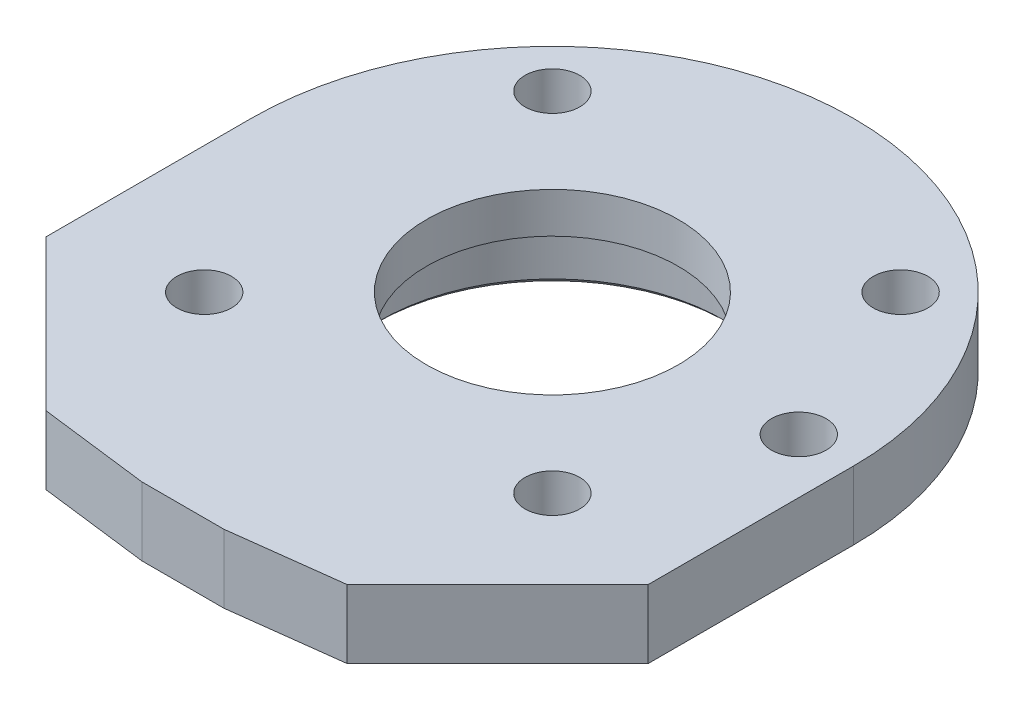
ISO-10303-21;
HEADER;
FILE_DESCRIPTION(('STEP AP214'),'2;1');
FILE_NAME('part.step','',(''),(''),'','','');
FILE_SCHEMA(('AUTOMOTIVE_DESIGN { 1 0 10303 214 1 1 1 1 }'));
ENDSEC;
DATA;
#1=APPLICATION_CONTEXT('core data for automotive mechanical design processes');
#2=APPLICATION_PROTOCOL_DEFINITION('international standard','automotive_design',2000,#1);
#3=PRODUCT_CONTEXT('',#1,'mechanical');
#4=PRODUCT('Part','Part','',(#3));
#5=PRODUCT_RELATED_PRODUCT_CATEGORY('part','',(#4));
#6=PRODUCT_DEFINITION_FORMATION('','',#4);
#7=PRODUCT_DEFINITION_CONTEXT('part definition',#1,'design');
#8=PRODUCT_DEFINITION('design','',#6,#7);
#9=PRODUCT_DEFINITION_SHAPE('','',#8);
#10=(LENGTH_UNIT() NAMED_UNIT(*) SI_UNIT(.MILLI.,.METRE.));
#11=(NAMED_UNIT(*) PLANE_ANGLE_UNIT() SI_UNIT($,.RADIAN.));
#12=(NAMED_UNIT(*) SI_UNIT($,.STERADIAN.) SOLID_ANGLE_UNIT());
#13=UNCERTAINTY_MEASURE_WITH_UNIT(LENGTH_MEASURE(1.E-05),#10,'distance_accuracy_value','');
#14=(GEOMETRIC_REPRESENTATION_CONTEXT(3) GLOBAL_UNCERTAINTY_ASSIGNED_CONTEXT((#13)) GLOBAL_UNIT_ASSIGNED_CONTEXT((#10,
#11,#12)) REPRESENTATION_CONTEXT('',''));
#15=CARTESIAN_POINT('',(0.,0.,0.));
#16=DIRECTION('',(0.,0.,1.));
#17=DIRECTION('',(1.,0.,0.));
#18=AXIS2_PLACEMENT_3D('',#15,#16,#17);
#19=CARTESIAN_POINT('',(0.,7.99999999999898,0.));
#20=DIRECTION('',(0.,-1.,0.));
#21=DIRECTION('',(1.,0.,0.));
#22=AXIS2_PLACEMENT_3D('',#19,#20,#21);
#23=CONICAL_SURFACE('',#22,64.499999999999,0.785398163396999);
#24=CARTESIAN_POINT('',(0.,7.99999999999898,0.));
#25=DIRECTION('',(0.,-1.,0.));
#26=DIRECTION('',(1.,0.,0.));
#27=AXIS2_PLACEMENT_3D('',#24,#25,#26);
#28=CIRCLE('',#27,64.499999999999);
#29=CARTESIAN_POINT('',(64.499999999999,7.99999999999898,0.));
#30=VERTEX_POINT('',#29);
#31=EDGE_CURVE('E20',#30,#30,#28,.T.);
#32=ORIENTED_EDGE('',*,*,#31,.T.);
#33=EDGE_LOOP('',(#32));
#34=FACE_BOUND('',#33,.T.);
#35=CARTESIAN_POINT('',(0.,10.,0.));
#36=DIRECTION('',(0.,1.,0.));
#37=DIRECTION('',(0.,0.,1.));
#38=AXIS2_PLACEMENT_3D('',#35,#36,#37);
#39=CIRCLE('',#38,62.5);
#40=CARTESIAN_POINT('',(0.,10.,62.5));
#41=VERTEX_POINT('',#40);
#42=EDGE_CURVE('E203',#41,#41,#39,.T.);
#43=ORIENTED_EDGE('',*,*,#42,.T.);
#44=EDGE_LOOP('',(#43));
#45=FACE_BOUND('',#44,.T.);
#46=ADVANCED_FACE('F17',(#34,#45),#23,.F.);
#47=CARTESIAN_POINT('',(0.,8.,0.));
#48=DIRECTION('',(0.,1.,0.));
#49=DIRECTION('',(0.,0.,1.));
#50=AXIS2_PLACEMENT_3D('',#47,#48,#49);
#51=CYLINDRICAL_SURFACE('',#50,62.5);
#52=CARTESIAN_POINT('',(0.,33.2,0.));
#53=DIRECTION('',(0.,1.,0.));
#54=DIRECTION('',(0.,0.,1.));
#55=AXIS2_PLACEMENT_3D('',#52,#53,#54);
#56=CIRCLE('',#55,62.5);
#57=CARTESIAN_POINT('',(0.,33.2,62.5));
#58=VERTEX_POINT('',#57);
#59=EDGE_CURVE('E269',#58,#58,#56,.T.);
#60=ORIENTED_EDGE('',*,*,#59,.T.);
#61=EDGE_LOOP('',(#60));
#62=FACE_BOUND('',#61,.T.);
#63=ORIENTED_EDGE('',*,*,#42,.F.);
#64=EDGE_LOOP('',(#63));
#65=FACE_BOUND('',#64,.T.);
#66=ADVANCED_FACE('F282',(#62,#65),#51,.F.);
#67=CARTESIAN_POINT('',(0.,8.,0.));
#68=DIRECTION('',(0.,1.,0.));
#69=DIRECTION('',(0.,0.,1.));
#70=AXIS2_PLACEMENT_3D('',#67,#68,#69);
#71=PLANE('',#70);
#72=ORIENTED_EDGE('',*,*,#31,.F.);
#73=EDGE_LOOP('',(#72));
#74=FACE_BOUND('',#73,.T.);
#75=CARTESIAN_POINT('',(0.,8.00000000000013,0.));
#76=DIRECTION('',(0.,1.,0.));
#77=DIRECTION('',(0.,0.,1.));
#78=AXIS2_PLACEMENT_3D('',#75,#76,#77);
#79=CIRCLE('',#78,72.9999999999999);
#80=CARTESIAN_POINT('',(0.,8.00000000000013,72.9999999999999));
#81=VERTEX_POINT('',#80);
#82=EDGE_CURVE('E267',#81,#81,#79,.T.);
#83=ORIENTED_EDGE('',*,*,#82,.F.);
#84=EDGE_LOOP('',(#83));
#85=FACE_BOUND('',#84,.T.);
#86=ADVANCED_FACE('F278',(#74,#85),#71,.F.);
#87=CARTESIAN_POINT('',(0.,33.2,0.));
#88=DIRECTION('',(0.,1.,0.));
#89=DIRECTION('',(0.,0.,1.));
#90=AXIS2_PLACEMENT_3D('',#87,#88,#89);
#91=PLANE('',#90);
#92=CARTESIAN_POINT('',(0.,33.2,0.));
#93=DIRECTION('',(0.,1.,0.));
#94=DIRECTION('',(0.,0.,1.));
#95=AXIS2_PLACEMENT_3D('',#92,#93,#94);
#96=CIRCLE('',#95,59.);
#97=CARTESIAN_POINT('',(0.,33.2,59.));
#98=VERTEX_POINT('',#97);
#99=EDGE_CURVE('E202',#98,#98,#96,.T.);
#100=ORIENTED_EDGE('',*,*,#99,.T.);
#101=EDGE_LOOP('',(#100));
#102=FACE_BOUND('',#101,.T.);
#103=ORIENTED_EDGE('',*,*,#59,.F.);
#104=EDGE_LOOP('',(#103));
#105=FACE_BOUND('',#104,.T.);
#106=ADVANCED_FACE('F281',(#102,#105),#91,.F.);
#107=CARTESIAN_POINT('',(0.,10.000000000001,0.));
#108=DIRECTION('',(0.,1.,0.));
#109=DIRECTION('',(0.,0.,1.));
#110=AXIS2_PLACEMENT_3D('',#107,#108,#109);
#111=CONICAL_SURFACE('',#110,74.999999999999,0.785398163397);
#112=ORIENTED_EDGE('',*,*,#82,.T.);
#113=EDGE_LOOP('',(#112));
#114=FACE_BOUND('',#113,.T.);
#115=CARTESIAN_POINT('',(0.,10.,0.));
#116=DIRECTION('',(0.,1.,0.));
#117=DIRECTION('',(0.,0.,1.));
#118=AXIS2_PLACEMENT_3D('',#115,#116,#117);
#119=CIRCLE('',#118,75.);
#120=CARTESIAN_POINT('',(0.,10.,75.));
#121=VERTEX_POINT('',#120);
#122=EDGE_CURVE('E198',#121,#121,#119,.T.);
#123=ORIENTED_EDGE('',*,*,#122,.F.);
#124=EDGE_LOOP('',(#123));
#125=FACE_BOUND('',#124,.T.);
#126=ADVANCED_FACE('F286',(#114,#125),#111,.T.);
#127=CARTESIAN_POINT('',(0.,33.2,0.));
#128=DIRECTION('',(0.,1.,0.));
#129=DIRECTION('',(0.,0.,1.));
#130=AXIS2_PLACEMENT_3D('',#127,#128,#129);
#131=CYLINDRICAL_SURFACE('',#130,59.);
#132=CARTESIAN_POINT('',(0.,35.2,0.));
#133=DIRECTION('',(0.,1.,0.));
#134=DIRECTION('',(0.,0.,1.));
#135=AXIS2_PLACEMENT_3D('',#132,#133,#134);
#136=CIRCLE('',#135,59.);
#137=CARTESIAN_POINT('',(0.,35.2,59.));
#138=VERTEX_POINT('',#137);
#139=EDGE_CURVE('E201',#138,#138,#136,.T.);
#140=ORIENTED_EDGE('',*,*,#139,.T.);
#141=EDGE_LOOP('',(#140));
#142=FACE_BOUND('',#141,.T.);
#143=ORIENTED_EDGE('',*,*,#99,.F.);
#144=EDGE_LOOP('',(#143));
#145=FACE_BOUND('',#144,.T.);
#146=ADVANCED_FACE('F289',(#142,#145),#131,.F.);
#147=CARTESIAN_POINT('',(0.,-497.410884005,0.));
#148=DIRECTION('',(0.,1.,0.));
#149=DIRECTION('',(0.,0.,1.));
#150=AXIS2_PLACEMENT_3D('',#147,#148,#149);
#151=CYLINDRICAL_SURFACE('',#150,75.);
#152=CARTESIAN_POINT('',(0.,25.,0.));
#153=DIRECTION('',(0.,1.,0.));
#154=DIRECTION('',(0.,0.,1.));
#155=AXIS2_PLACEMENT_3D('',#152,#153,#154);
#156=CIRCLE('',#155,75.);
#157=CARTESIAN_POINT('',(0.,25.,75.));
#158=VERTEX_POINT('',#157);
#159=EDGE_CURVE('E260',#158,#158,#156,.F.);
#160=ORIENTED_EDGE('',*,*,#159,.T.);
#161=EDGE_LOOP('',(#160));
#162=FACE_BOUND('',#161,.T.);
#163=ORIENTED_EDGE('',*,*,#122,.T.);
#164=EDGE_LOOP('',(#163));
#165=FACE_BOUND('',#164,.T.);
#166=ADVANCED_FACE('F293',(#162,#165),#151,.T.);
#167=CARTESIAN_POINT('',(63.6,25.,-63.6));
#168=DIRECTION('',(0.,1.,0.));
#169=DIRECTION('',(0.,0.,1.));
#170=AXIS2_PLACEMENT_3D('',#167,#168,#169);
#171=CYLINDRICAL_SURFACE('',#170,7.);
#172=CARTESIAN_POINT('',(63.6,25.,-63.6));
#173=DIRECTION('',(0.,1.,0.));
#174=DIRECTION('',(0.,0.,1.));
#175=AXIS2_PLACEMENT_3D('',#172,#173,#174);
#176=CIRCLE('',#175,7.);
#177=CARTESIAN_POINT('',(63.6,25.,-56.6));
#178=VERTEX_POINT('',#177);
#179=EDGE_CURVE('E257',#178,#178,#176,.F.);
#180=ORIENTED_EDGE('',*,*,#179,.T.);
#181=EDGE_LOOP('',(#180));
#182=FACE_BOUND('',#181,.T.);
#183=CARTESIAN_POINT('',(63.6,34.,-63.6));
#184=DIRECTION('',(0.,1.,0.));
#185=DIRECTION('',(0.,0.,1.));
#186=AXIS2_PLACEMENT_3D('',#183,#184,#185);
#187=CIRCLE('',#186,7.);
#188=CARTESIAN_POINT('',(63.6,34.,-56.6));
#189=VERTEX_POINT('',#188);
#190=EDGE_CURVE('E245',#189,#189,#187,.T.);
#191=ORIENTED_EDGE('',*,*,#190,.T.);
#192=EDGE_LOOP('',(#191));
#193=FACE_BOUND('',#192,.T.);
#194=ADVANCED_FACE('F295',(#182,#193),#171,.F.);
#195=CARTESIAN_POINT('',(-63.6,25.,-63.6));
#196=DIRECTION('',(0.,-1.,0.));
#197=DIRECTION('',(0.,0.,-1.));
#198=AXIS2_PLACEMENT_3D('',#195,#196,#197);
#199=CYLINDRICAL_SURFACE('',#198,7.);
#200=CARTESIAN_POINT('',(-63.6,25.,-63.6));
#201=DIRECTION('',(0.,-1.,0.));
#202=DIRECTION('',(0.,0.,-1.));
#203=AXIS2_PLACEMENT_3D('',#200,#201,#202);
#204=CIRCLE('',#203,7.);
#205=CARTESIAN_POINT('',(-63.6,25.,-70.6));
#206=VERTEX_POINT('',#205);
#207=EDGE_CURVE('E254',#206,#206,#204,.T.);
#208=ORIENTED_EDGE('',*,*,#207,.T.);
#209=EDGE_LOOP('',(#208));
#210=FACE_BOUND('',#209,.T.);
#211=CARTESIAN_POINT('',(-63.6,34.,-63.6));
#212=DIRECTION('',(0.,-1.,0.));
#213=DIRECTION('',(0.,0.,-1.));
#214=AXIS2_PLACEMENT_3D('',#211,#212,#213);
#215=CIRCLE('',#214,7.);
#216=CARTESIAN_POINT('',(-63.6,34.,-70.6));
#217=VERTEX_POINT('',#216);
#218=EDGE_CURVE('E242',#217,#217,#215,.T.);
#219=ORIENTED_EDGE('',*,*,#218,.F.);
#220=EDGE_LOOP('',(#219));
#221=FACE_BOUND('',#220,.T.);
#222=ADVANCED_FACE('F303',(#210,#221),#199,.F.);
#223=CARTESIAN_POINT('',(-63.6,25.,63.6));
#224=DIRECTION('',(0.,1.,0.));
#225=DIRECTION('',(0.,0.,1.));
#226=AXIS2_PLACEMENT_3D('',#223,#224,#225);
#227=CYLINDRICAL_SURFACE('',#226,7.);
#228=CARTESIAN_POINT('',(-63.6,25.,63.6));
#229=DIRECTION('',(0.,1.,0.));
#230=DIRECTION('',(0.,0.,1.));
#231=AXIS2_PLACEMENT_3D('',#228,#229,#230);
#232=CIRCLE('',#231,7.);
#233=CARTESIAN_POINT('',(-63.6,25.,70.6));
#234=VERTEX_POINT('',#233);
#235=EDGE_CURVE('E251',#234,#234,#232,.F.);
#236=ORIENTED_EDGE('',*,*,#235,.T.);
#237=EDGE_LOOP('',(#236));
#238=FACE_BOUND('',#237,.T.);
#239=CARTESIAN_POINT('',(-63.6,34.,63.6));
#240=DIRECTION('',(0.,1.,0.));
#241=DIRECTION('',(0.,0.,1.));
#242=AXIS2_PLACEMENT_3D('',#239,#240,#241);
#243=CIRCLE('',#242,7.);
#244=CARTESIAN_POINT('',(-63.6,34.,70.6));
#245=VERTEX_POINT('',#244);
#246=EDGE_CURVE('E239',#245,#245,#243,.T.);
#247=ORIENTED_EDGE('',*,*,#246,.T.);
#248=EDGE_LOOP('',(#247));
#249=FACE_BOUND('',#248,.T.);
#250=ADVANCED_FACE('F392',(#238,#249),#227,.F.);
#251=CARTESIAN_POINT('',(63.6,25.,63.6));
#252=DIRECTION('',(0.,-1.,0.));
#253=DIRECTION('',(0.,0.,-1.));
#254=AXIS2_PLACEMENT_3D('',#251,#252,#253);
#255=CYLINDRICAL_SURFACE('',#254,7.);
#256=CARTESIAN_POINT('',(63.6,25.,63.6));
#257=DIRECTION('',(0.,-1.,0.));
#258=DIRECTION('',(0.,0.,-1.));
#259=AXIS2_PLACEMENT_3D('',#256,#257,#258);
#260=CIRCLE('',#259,7.);
#261=CARTESIAN_POINT('',(63.6,25.,56.6));
#262=VERTEX_POINT('',#261);
#263=EDGE_CURVE('E248',#262,#262,#260,.T.);
#264=ORIENTED_EDGE('',*,*,#263,.T.);
#265=EDGE_LOOP('',(#264));
#266=FACE_BOUND('',#265,.T.);
#267=CARTESIAN_POINT('',(63.6,34.,63.6));
#268=DIRECTION('',(0.,-1.,0.));
#269=DIRECTION('',(0.,0.,-1.));
#270=AXIS2_PLACEMENT_3D('',#267,#268,#269);
#271=CIRCLE('',#270,7.);
#272=CARTESIAN_POINT('',(63.6,34.,56.6));
#273=VERTEX_POINT('',#272);
#274=EDGE_CURVE('E180',#273,#273,#271,.T.);
#275=ORIENTED_EDGE('',*,*,#274,.F.);
#276=EDGE_LOOP('',(#275));
#277=FACE_BOUND('',#276,.T.);
#278=ADVANCED_FACE('F388',(#266,#277),#255,.F.);
#279=CARTESIAN_POINT('',(0.,35.2,0.));
#280=DIRECTION('',(0.,1.,0.));
#281=DIRECTION('',(0.,0.,1.));
#282=AXIS2_PLACEMENT_3D('',#279,#280,#281);
#283=PLANE('',#282);
#284=CARTESIAN_POINT('',(0.,35.2,0.));
#285=DIRECTION('',(0.,1.,0.));
#286=DIRECTION('',(0.,0.,1.));
#287=AXIS2_PLACEMENT_3D('',#284,#285,#286);
#288=CIRCLE('',#287,46.);
#289=CARTESIAN_POINT('',(0.,35.2,46.));
#290=VERTEX_POINT('',#289);
#291=EDGE_CURVE('E232',#290,#290,#288,.T.);
#292=ORIENTED_EDGE('',*,*,#291,.T.);
#293=EDGE_LOOP('',(#292));
#294=FACE_BOUND('',#293,.T.);
#295=ORIENTED_EDGE('',*,*,#139,.F.);
#296=EDGE_LOOP('',(#295));
#297=FACE_BOUND('',#296,.T.);
#298=ADVANCED_FACE('F384',(#294,#297),#283,.F.);
#299=CARTESIAN_POINT('',(0.,25.,0.));
#300=DIRECTION('',(0.,1.,0.));
#301=DIRECTION('',(0.,0.,1.));
#302=AXIS2_PLACEMENT_3D('',#299,#300,#301);
#303=PLANE('',#302);
#304=CARTESIAN_POINT('',(90.,25.,0.));
#305=DIRECTION('',(0.,1.,0.));
#306=DIRECTION('',(0.,0.,1.));
#307=AXIS2_PLACEMENT_3D('',#304,#305,#306);
#308=CIRCLE('',#307,10.);
#309=CARTESIAN_POINT('',(90.,25.,10.));
#310=VERTEX_POINT('',#309);
#311=EDGE_CURVE('E229',#310,#310,#308,.T.);
#312=ORIENTED_EDGE('',*,*,#311,.T.);
#313=EDGE_LOOP('',(#312));
#314=FACE_BOUND('',#313,.T.);
#315=ORIENTED_EDGE('',*,*,#263,.F.);
#316=EDGE_LOOP('',(#315));
#317=FACE_BOUND('',#316,.T.);
#318=ORIENTED_EDGE('',*,*,#235,.F.);
#319=EDGE_LOOP('',(#318));
#320=FACE_BOUND('',#319,.T.);
#321=ORIENTED_EDGE('',*,*,#207,.F.);
#322=EDGE_LOOP('',(#321));
#323=FACE_BOUND('',#322,.T.);
#324=ORIENTED_EDGE('',*,*,#179,.F.);
#325=EDGE_LOOP('',(#324));
#326=FACE_BOUND('',#325,.T.);
#327=ORIENTED_EDGE('',*,*,#159,.F.);
#328=EDGE_LOOP('',(#327));
#329=FACE_BOUND('',#328,.T.);
#330=DIRECTION('',(0.707106781186548,0.,-0.707106781186548));
#331=VECTOR('',#330,1.);
#332=CARTESIAN_POINT('',(55.,25.,130.));
#333=LINE('',#332,#331);
#334=CARTESIAN_POINT('',(55.0000000000004,25.,130.000000000003));
#335=VERTEX_POINT('',#334);
#336=CARTESIAN_POINT('',(110.,25.,75.));
#337=VERTEX_POINT('',#336);
#338=EDGE_CURVE('E65',#335,#337,#333,.T.);
#339=ORIENTED_EDGE('',*,*,#338,.F.);
#340=DIRECTION('',(0.992277876713698,0.,-0.124034734588962));
#341=VECTOR('',#340,1.);
#342=CARTESIAN_POINT('',(15.,25.,135.));
#343=LINE('',#342,#341);
#344=CARTESIAN_POINT('',(15.,25.,135.));
#345=VERTEX_POINT('',#344);
#346=EDGE_CURVE('E142',#345,#335,#343,.T.);
#347=ORIENTED_EDGE('',*,*,#346,.F.);
#348=DIRECTION('',(1.,0.,0.));
#349=VECTOR('',#348,1.);
#350=CARTESIAN_POINT('',(-15.,25.,135.));
#351=LINE('',#350,#349);
#352=CARTESIAN_POINT('',(-14.9999999999996,25.,134.999999999997));
#353=VERTEX_POINT('',#352);
#354=EDGE_CURVE('E153',#353,#345,#351,.T.);
#355=ORIENTED_EDGE('',*,*,#354,.F.);
#356=DIRECTION('',(0.992277876713698,0.,0.124034734588962));
#357=VECTOR('',#356,1.);
#358=CARTESIAN_POINT('',(-55.,25.,130.));
#359=LINE('',#358,#357);
#360=CARTESIAN_POINT('',(-55.,25.,130.));
#361=VERTEX_POINT('',#360);
#362=EDGE_CURVE('E163',#361,#353,#359,.T.);
#363=ORIENTED_EDGE('',*,*,#362,.F.);
#364=DIRECTION('',(0.707106781186548,0.,0.707106781186548));
#365=VECTOR('',#364,1.);
#366=CARTESIAN_POINT('',(-110.,25.,75.));
#367=LINE('',#366,#365);
#368=CARTESIAN_POINT('',(-110.,25.,75.));
#369=VERTEX_POINT('',#368);
#370=EDGE_CURVE('E98',#369,#361,#367,.T.);
#371=ORIENTED_EDGE('',*,*,#370,.F.);
#372=DIRECTION('',(0.,0.,1.));
#373=VECTOR('',#372,1.);
#374=CARTESIAN_POINT('',(-110.,25.,0.));
#375=LINE('',#374,#373);
#376=CARTESIAN_POINT('',(-110.,25.,0.));
#377=VERTEX_POINT('',#376);
#378=EDGE_CURVE('E57',#377,#369,#375,.T.);
#379=ORIENTED_EDGE('',*,*,#378,.F.);
#380=CARTESIAN_POINT('',(0.,25.,0.));
#381=DIRECTION('',(0.,1.,0.));
#382=DIRECTION('',(0.,0.,1.));
#383=AXIS2_PLACEMENT_3D('',#380,#381,#382);
#384=CIRCLE('',#383,110.);
#385=CARTESIAN_POINT('',(110.,25.,0.));
#386=VERTEX_POINT('',#385);
#387=EDGE_CURVE('E128',#386,#377,#384,.T.);
#388=ORIENTED_EDGE('',*,*,#387,.F.);
#389=DIRECTION('',(0.,0.,-1.));
#390=VECTOR('',#389,1.);
#391=CARTESIAN_POINT('',(110.,25.,75.));
#392=LINE('',#391,#390);
#393=EDGE_CURVE('E50',#337,#386,#392,.T.);
#394=ORIENTED_EDGE('',*,*,#393,.F.);
#395=EDGE_LOOP('',(#339,#347,#355,#363,#371,#379,#388,#394));
#396=FACE_BOUND('',#395,.T.);
#397=ADVANCED_FACE('F380',(#314,#317,#320,#323,#326,#329,#396),#303,.F.);
#398=CARTESIAN_POINT('',(63.6,34.,-63.6));
#399=DIRECTION('',(0.,-1.,0.));
#400=DIRECTION('',(0.,0.,-1.));
#401=AXIS2_PLACEMENT_3D('',#398,#399,#400);
#402=PLANE('',#401);
#403=ORIENTED_EDGE('',*,*,#190,.F.);
#404=EDGE_LOOP('',(#403));
#405=FACE_BOUND('',#404,.T.);
#406=CARTESIAN_POINT('',(63.6,34.,-63.6));
#407=DIRECTION('',(0.,-1.,0.));
#408=DIRECTION('',(0.,0.,-1.));
#409=AXIS2_PLACEMENT_3D('',#406,#407,#408);
#410=CIRCLE('',#409,10.);
#411=CARTESIAN_POINT('',(63.6,34.,-73.6));
#412=VERTEX_POINT('',#411);
#413=EDGE_CURVE('E226',#412,#412,#410,.F.);
#414=ORIENTED_EDGE('',*,*,#413,.T.);
#415=EDGE_LOOP('',(#414));
#416=FACE_BOUND('',#415,.T.);
#417=ADVANCED_FACE('F376',(#405,#416),#402,.F.);
#418=CARTESIAN_POINT('',(-63.6,34.,-63.6));
#419=DIRECTION('',(0.,1.,0.));
#420=DIRECTION('',(0.,0.,1.));
#421=AXIS2_PLACEMENT_3D('',#418,#419,#420);
#422=PLANE('',#421);
#423=ORIENTED_EDGE('',*,*,#218,.T.);
#424=EDGE_LOOP('',(#423));
#425=FACE_BOUND('',#424,.T.);
#426=CARTESIAN_POINT('',(-63.6,34.,-63.6));
#427=DIRECTION('',(0.,1.,0.));
#428=DIRECTION('',(0.,0.,1.));
#429=AXIS2_PLACEMENT_3D('',#426,#427,#428);
#430=CIRCLE('',#429,10.);
#431=CARTESIAN_POINT('',(-63.6,34.,-53.6));
#432=VERTEX_POINT('',#431);
#433=EDGE_CURVE('E223',#432,#432,#430,.T.);
#434=ORIENTED_EDGE('',*,*,#433,.T.);
#435=EDGE_LOOP('',(#434));
#436=FACE_BOUND('',#435,.T.);
#437=ADVANCED_FACE('F372',(#425,#436),#422,.T.);
#438=CARTESIAN_POINT('',(-63.6,34.,63.6));
#439=DIRECTION('',(0.,-1.,0.));
#440=DIRECTION('',(0.,0.,-1.));
#441=AXIS2_PLACEMENT_3D('',#438,#439,#440);
#442=PLANE('',#441);
#443=ORIENTED_EDGE('',*,*,#246,.F.);
#444=EDGE_LOOP('',(#443));
#445=FACE_BOUND('',#444,.T.);
#446=CARTESIAN_POINT('',(-63.6,34.,63.6));
#447=DIRECTION('',(0.,-1.,0.));
#448=DIRECTION('',(0.,0.,-1.));
#449=AXIS2_PLACEMENT_3D('',#446,#447,#448);
#450=CIRCLE('',#449,10.);
#451=CARTESIAN_POINT('',(-63.6,34.,53.6));
#452=VERTEX_POINT('',#451);
#453=EDGE_CURVE('E117',#452,#452,#450,.F.);
#454=ORIENTED_EDGE('',*,*,#453,.T.);
#455=EDGE_LOOP('',(#454));
#456=FACE_BOUND('',#455,.T.);
#457=ADVANCED_FACE('F368',(#445,#456),#442,.F.);
#458=CARTESIAN_POINT('',(63.6,34.,63.6));
#459=DIRECTION('',(0.,1.,0.));
#460=DIRECTION('',(0.,0.,1.));
#461=AXIS2_PLACEMENT_3D('',#458,#459,#460);
#462=PLANE('',#461);
#463=ORIENTED_EDGE('',*,*,#274,.T.);
#464=EDGE_LOOP('',(#463));
#465=FACE_BOUND('',#464,.T.);
#466=CARTESIAN_POINT('',(63.6,34.,63.6));
#467=DIRECTION('',(0.,1.,0.));
#468=DIRECTION('',(0.,0.,1.));
#469=AXIS2_PLACEMENT_3D('',#466,#467,#468);
#470=CIRCLE('',#469,10.);
#471=CARTESIAN_POINT('',(63.6,34.,73.6));
#472=VERTEX_POINT('',#471);
#473=EDGE_CURVE('E114',#472,#472,#470,.T.);
#474=ORIENTED_EDGE('',*,*,#473,.T.);
#475=EDGE_LOOP('',(#474));
#476=FACE_BOUND('',#475,.T.);
#477=ADVANCED_FACE('F365',(#465,#476),#462,.T.);
#478=CARTESIAN_POINT('',(-110.,0.,0.));
#479=DIRECTION('',(-1.,0.,0.));
#480=DIRECTION('',(0.,0.,1.));
#481=AXIS2_PLACEMENT_3D('',#478,#479,#480);
#482=PLANE('',#481);
#483=DIRECTION('',(0.,1.,0.));
#484=VECTOR('',#483,1.);
#485=CARTESIAN_POINT('',(-110.,0.,0.));
#486=LINE('',#485,#484);
#487=CARTESIAN_POINT('',(-110.,50.,0.));
#488=VERTEX_POINT('',#487);
#489=EDGE_CURVE('E125',#377,#488,#486,.T.);
#490=ORIENTED_EDGE('',*,*,#489,.F.);
#491=ORIENTED_EDGE('',*,*,#378,.T.);
#492=DIRECTION('',(0.,1.,0.));
#493=VECTOR('',#492,1.);
#494=CARTESIAN_POINT('',(-110.,0.,75.));
#495=LINE('',#494,#493);
#496=CARTESIAN_POINT('',(-110.,50.,75.));
#497=VERTEX_POINT('',#496);
#498=EDGE_CURVE('E91',#497,#369,#495,.F.);
#499=ORIENTED_EDGE('',*,*,#498,.F.);
#500=DIRECTION('',(0.,0.,1.));
#501=VECTOR('',#500,1.);
#502=CARTESIAN_POINT('',(-110.,50.,0.));
#503=LINE('',#502,#501);
#504=EDGE_CURVE('E95',#488,#497,#503,.T.);
#505=ORIENTED_EDGE('',*,*,#504,.F.);
#506=EDGE_LOOP('',(#490,#491,#499,#505));
#507=FACE_BOUND('',#506,.T.);
#508=ADVANCED_FACE('F93',(#507),#482,.T.);
#509=CARTESIAN_POINT('',(-110.,0.,75.));
#510=DIRECTION('',(-0.707106781186548,0.,0.707106781186548));
#511=DIRECTION('',(0.707106781186548,0.,0.707106781186548));
#512=AXIS2_PLACEMENT_3D('',#509,#510,#511);
#513=PLANE('',#512);
#514=ORIENTED_EDGE('',*,*,#498,.T.);
#515=ORIENTED_EDGE('',*,*,#370,.T.);
#516=DIRECTION('',(0.,1.,0.));
#517=VECTOR('',#516,1.);
#518=CARTESIAN_POINT('',(-55.,0.,130.));
#519=LINE('',#518,#517);
#520=CARTESIAN_POINT('',(-55.,50.,130.));
#521=VERTEX_POINT('',#520);
#522=EDGE_CURVE('E104',#521,#361,#519,.F.);
#523=ORIENTED_EDGE('',*,*,#522,.F.);
#524=DIRECTION('',(0.707106781186548,0.,0.707106781186548));
#525=VECTOR('',#524,1.);
#526=CARTESIAN_POINT('',(-110.,50.,75.));
#527=LINE('',#526,#525);
#528=EDGE_CURVE('E101',#497,#521,#527,.T.);
#529=ORIENTED_EDGE('',*,*,#528,.F.);
#530=EDGE_LOOP('',(#514,#515,#523,#529));
#531=FACE_BOUND('',#530,.T.);
#532=ADVANCED_FACE('F102',(#531),#513,.T.);
#533=CARTESIAN_POINT('',(-55.,0.,130.));
#534=DIRECTION('',(-0.124034734588962,0.,0.992277876713698));
#535=DIRECTION('',(0.992277876713698,0.,0.124034734588962));
#536=AXIS2_PLACEMENT_3D('',#533,#534,#535);
#537=PLANE('',#536);
#538=ORIENTED_EDGE('',*,*,#522,.T.);
#539=ORIENTED_EDGE('',*,*,#362,.T.);
#540=DIRECTION('',(0.,1.,0.));
#541=VECTOR('',#540,1.);
#542=CARTESIAN_POINT('',(-15.,0.,135.));
#543=LINE('',#542,#541);
#544=CARTESIAN_POINT('',(-15.0000000000001,50.,135.));
#545=VERTEX_POINT('',#544);
#546=EDGE_CURVE('E160',#545,#353,#543,.F.);
#547=ORIENTED_EDGE('',*,*,#546,.F.);
#548=DIRECTION('',(0.992277876713668,0.,0.124034734589209));
#549=VECTOR('',#548,1.);
#550=CARTESIAN_POINT('',(-55.,50.,130.));
#551=LINE('',#550,#549);
#552=EDGE_CURVE('E108',#521,#545,#551,.T.);
#553=ORIENTED_EDGE('',*,*,#552,.F.);
#554=EDGE_LOOP('',(#538,#539,#547,#553));
#555=FACE_BOUND('',#554,.T.);
#556=ADVANCED_FACE('F356',(#555),#537,.T.);
#557=CARTESIAN_POINT('',(-15.,0.,135.));
#558=DIRECTION('',(0.,0.,1.));
#559=DIRECTION('',(1.,0.,0.));
#560=AXIS2_PLACEMENT_3D('',#557,#558,#559);
#561=PLANE('',#560);
#562=ORIENTED_EDGE('',*,*,#546,.T.);
#563=ORIENTED_EDGE('',*,*,#354,.T.);
#564=DIRECTION('',(0.,1.,0.));
#565=VECTOR('',#564,1.);
#566=CARTESIAN_POINT('',(15.,0.,135.));
#567=LINE('',#566,#565);
#568=CARTESIAN_POINT('',(15.,50.,135.));
#569=VERTEX_POINT('',#568);
#570=EDGE_CURVE('E150',#569,#345,#567,.F.);
#571=ORIENTED_EDGE('',*,*,#570,.F.);
#572=DIRECTION('',(1.,0.,0.));
#573=VECTOR('',#572,1.);
#574=CARTESIAN_POINT('',(0.,50.,135.));
#575=LINE('',#574,#573);
#576=EDGE_CURVE('E147',#545,#569,#575,.T.);
#577=ORIENTED_EDGE('',*,*,#576,.F.);
#578=EDGE_LOOP('',(#562,#563,#571,#577));
#579=FACE_BOUND('',#578,.T.);
#580=ADVANCED_FACE('F352',(#579),#561,.T.);
#581=CARTESIAN_POINT('',(15.,0.,135.));
#582=DIRECTION('',(0.124034734588962,0.,0.992277876713698));
#583=DIRECTION('',(0.992277876713698,0.,-0.124034734588962));
#584=AXIS2_PLACEMENT_3D('',#581,#582,#583);
#585=PLANE('',#584);
#586=ORIENTED_EDGE('',*,*,#570,.T.);
#587=ORIENTED_EDGE('',*,*,#346,.T.);
#588=DIRECTION('',(0.,1.,0.));
#589=VECTOR('',#588,1.);
#590=CARTESIAN_POINT('',(55.,0.,130.));
#591=LINE('',#590,#589);
#592=CARTESIAN_POINT('',(55.,50.,130.));
#593=VERTEX_POINT('',#592);
#594=EDGE_CURVE('E140',#593,#335,#591,.F.);
#595=ORIENTED_EDGE('',*,*,#594,.F.);
#596=DIRECTION('',(0.992277876713668,0.,-0.124034734589209));
#597=VECTOR('',#596,1.);
#598=CARTESIAN_POINT('',(15.,50.,135.));
#599=LINE('',#598,#597);
#600=EDGE_CURVE('E137',#569,#593,#599,.T.);
#601=ORIENTED_EDGE('',*,*,#600,.F.);
#602=EDGE_LOOP('',(#586,#587,#595,#601));
#603=FACE_BOUND('',#602,.T.);
#604=ADVANCED_FACE('F349',(#603),#585,.T.);
#605=CARTESIAN_POINT('',(55.,0.,130.));
#606=DIRECTION('',(0.707106781186548,0.,0.707106781186548));
#607=DIRECTION('',(0.707106781186548,0.,-0.707106781186548));
#608=AXIS2_PLACEMENT_3D('',#605,#606,#607);
#609=PLANE('',#608);
#610=ORIENTED_EDGE('',*,*,#594,.T.);
#611=ORIENTED_EDGE('',*,*,#338,.T.);
#612=DIRECTION('',(0.,1.,0.));
#613=VECTOR('',#612,1.);
#614=CARTESIAN_POINT('',(110.,0.,75.));
#615=LINE('',#614,#613);
#616=CARTESIAN_POINT('',(110.,50.,75.));
#617=VERTEX_POINT('',#616);
#618=EDGE_CURVE('E129',#617,#337,#615,.F.);
#619=ORIENTED_EDGE('',*,*,#618,.F.);
#620=DIRECTION('',(0.707106781186548,0.,-0.707106781186548));
#621=VECTOR('',#620,1.);
#622=CARTESIAN_POINT('',(55.,50.,130.));
#623=LINE('',#622,#621);
#624=EDGE_CURVE('E133',#593,#617,#623,.T.);
#625=ORIENTED_EDGE('',*,*,#624,.F.);
#626=EDGE_LOOP('',(#610,#611,#619,#625));
#627=FACE_BOUND('',#626,.T.);
#628=ADVANCED_FACE('F346',(#627),#609,.T.);
#629=CARTESIAN_POINT('',(110.,0.,75.));
#630=DIRECTION('',(1.,0.,0.));
#631=DIRECTION('',(0.,0.,-1.));
#632=AXIS2_PLACEMENT_3D('',#629,#630,#631);
#633=PLANE('',#632);
#634=ORIENTED_EDGE('',*,*,#618,.T.);
#635=ORIENTED_EDGE('',*,*,#393,.T.);
#636=DIRECTION('',(0.,1.,0.));
#637=VECTOR('',#636,1.);
#638=CARTESIAN_POINT('',(110.,0.,0.));
#639=LINE('',#638,#637);
#640=CARTESIAN_POINT('',(110.,50.,0.));
#641=VERTEX_POINT('',#640);
#642=EDGE_CURVE('E35',#641,#386,#639,.F.);
#643=ORIENTED_EDGE('',*,*,#642,.F.);
#644=DIRECTION('',(0.,0.,1.));
#645=VECTOR('',#644,1.);
#646=CARTESIAN_POINT('',(110.,50.,0.));
#647=LINE('',#646,#645);
#648=EDGE_CURVE('E136',#617,#641,#647,.F.);
#649=ORIENTED_EDGE('',*,*,#648,.F.);
#650=EDGE_LOOP('',(#634,#635,#643,#649));
#651=FACE_BOUND('',#650,.T.);
#652=ADVANCED_FACE('F342',(#651),#633,.T.);
#653=CARTESIAN_POINT('',(0.,0.,0.));
#654=DIRECTION('',(0.,1.,0.));
#655=DIRECTION('',(0.,0.,1.));
#656=AXIS2_PLACEMENT_3D('',#653,#654,#655);
#657=CYLINDRICAL_SURFACE('',#656,110.);
#658=ORIENTED_EDGE('',*,*,#642,.T.);
#659=ORIENTED_EDGE('',*,*,#387,.T.);
#660=ORIENTED_EDGE('',*,*,#489,.T.);
#661=CARTESIAN_POINT('',(0.,50.,0.));
#662=DIRECTION('',(0.,1.,0.));
#663=DIRECTION('',(0.,0.,1.));
#664=AXIS2_PLACEMENT_3D('',#661,#662,#663);
#665=CIRCLE('',#664,110.);
#666=EDGE_CURVE('E113',#641,#488,#665,.T.);
#667=ORIENTED_EDGE('',*,*,#666,.F.);
#668=EDGE_LOOP('',(#658,#659,#660,#667));
#669=FACE_BOUND('',#668,.T.);
#670=ADVANCED_FACE('F338',(#669),#657,.T.);
#671=CARTESIAN_POINT('',(0.,0.,0.));
#672=DIRECTION('',(0.,1.,0.));
#673=DIRECTION('',(0.,0.,1.));
#674=AXIS2_PLACEMENT_3D('',#671,#672,#673);
#675=CYLINDRICAL_SURFACE('',#674,46.);
#676=CARTESIAN_POINT('',(0.,50.,0.));
#677=DIRECTION('',(0.,1.,0.));
#678=DIRECTION('',(0.,0.,1.));
#679=AXIS2_PLACEMENT_3D('',#676,#677,#678);
#680=CIRCLE('',#679,46.);
#681=CARTESIAN_POINT('',(0.,50.,46.));
#682=VERTEX_POINT('',#681);
#683=EDGE_CURVE('E217',#682,#682,#680,.F.);
#684=ORIENTED_EDGE('',*,*,#683,.F.);
#685=EDGE_LOOP('',(#684));
#686=FACE_BOUND('',#685,.T.);
#687=ORIENTED_EDGE('',*,*,#291,.F.);
#688=EDGE_LOOP('',(#687));
#689=FACE_BOUND('',#688,.T.);
#690=ADVANCED_FACE('F334',(#686,#689),#675,.F.);
#691=CARTESIAN_POINT('',(90.,25.,0.));
#692=DIRECTION('',(0.,1.,0.));
#693=DIRECTION('',(0.,0.,1.));
#694=AXIS2_PLACEMENT_3D('',#691,#692,#693);
#695=CYLINDRICAL_SURFACE('',#694,10.);
#696=ORIENTED_EDGE('',*,*,#311,.F.);
#697=EDGE_LOOP('',(#696));
#698=FACE_BOUND('',#697,.T.);
#699=CARTESIAN_POINT('',(90.,50.,0.));
#700=DIRECTION('',(0.,1.,0.));
#701=DIRECTION('',(0.,0.,1.));
#702=AXIS2_PLACEMENT_3D('',#699,#700,#701);
#703=CIRCLE('',#702,10.);
#704=CARTESIAN_POINT('',(90.,50.,10.));
#705=VERTEX_POINT('',#704);
#706=EDGE_CURVE('E214',#705,#705,#703,.F.);
#707=ORIENTED_EDGE('',*,*,#706,.F.);
#708=EDGE_LOOP('',(#707));
#709=FACE_BOUND('',#708,.T.);
#710=ADVANCED_FACE('F330',(#698,#709),#695,.F.);
#711=CARTESIAN_POINT('',(63.6,50.,-63.6));
#712=DIRECTION('',(0.,-1.,0.));
#713=DIRECTION('',(0.,0.,-1.));
#714=AXIS2_PLACEMENT_3D('',#711,#712,#713);
#715=CYLINDRICAL_SURFACE('',#714,10.);
#716=ORIENTED_EDGE('',*,*,#413,.F.);
#717=EDGE_LOOP('',(#716));
#718=FACE_BOUND('',#717,.T.);
#719=CARTESIAN_POINT('',(63.6,50.,-63.6));
#720=DIRECTION('',(0.,-1.,0.));
#721=DIRECTION('',(0.,0.,-1.));
#722=AXIS2_PLACEMENT_3D('',#719,#720,#721);
#723=CIRCLE('',#722,10.);
#724=CARTESIAN_POINT('',(63.6,50.,-73.6));
#725=VERTEX_POINT('',#724);
#726=EDGE_CURVE('E211',#725,#725,#723,.T.);
#727=ORIENTED_EDGE('',*,*,#726,.F.);
#728=EDGE_LOOP('',(#727));
#729=FACE_BOUND('',#728,.T.);
#730=ADVANCED_FACE('F326',(#718,#729),#715,.F.);
#731=CARTESIAN_POINT('',(-63.6,50.,-63.6));
#732=DIRECTION('',(0.,1.,0.));
#733=DIRECTION('',(0.,0.,1.));
#734=AXIS2_PLACEMENT_3D('',#731,#732,#733);
#735=CYLINDRICAL_SURFACE('',#734,10.);
#736=ORIENTED_EDGE('',*,*,#433,.F.);
#737=EDGE_LOOP('',(#736));
#738=FACE_BOUND('',#737,.T.);
#739=CARTESIAN_POINT('',(-63.6,50.,-63.6));
#740=DIRECTION('',(0.,1.,0.));
#741=DIRECTION('',(0.,0.,1.));
#742=AXIS2_PLACEMENT_3D('',#739,#740,#741);
#743=CIRCLE('',#742,10.);
#744=CARTESIAN_POINT('',(-63.6,50.,-53.6));
#745=VERTEX_POINT('',#744);
#746=EDGE_CURVE('E208',#745,#745,#743,.F.);
#747=ORIENTED_EDGE('',*,*,#746,.F.);
#748=EDGE_LOOP('',(#747));
#749=FACE_BOUND('',#748,.T.);
#750=ADVANCED_FACE('F322',(#738,#749),#735,.F.);
#751=CARTESIAN_POINT('',(-63.6,50.,63.6));
#752=DIRECTION('',(0.,-1.,0.));
#753=DIRECTION('',(0.,0.,-1.));
#754=AXIS2_PLACEMENT_3D('',#751,#752,#753);
#755=CYLINDRICAL_SURFACE('',#754,10.);
#756=ORIENTED_EDGE('',*,*,#453,.F.);
#757=EDGE_LOOP('',(#756));
#758=FACE_BOUND('',#757,.T.);
#759=CARTESIAN_POINT('',(-63.6,50.,63.6));
#760=DIRECTION('',(0.,-1.,0.));
#761=DIRECTION('',(0.,0.,-1.));
#762=AXIS2_PLACEMENT_3D('',#759,#760,#761);
#763=CIRCLE('',#762,10.);
#764=CARTESIAN_POINT('',(-63.6,50.,53.6));
#765=VERTEX_POINT('',#764);
#766=EDGE_CURVE('E26',#765,#765,#763,.T.);
#767=ORIENTED_EDGE('',*,*,#766,.F.);
#768=EDGE_LOOP('',(#767));
#769=FACE_BOUND('',#768,.T.);
#770=ADVANCED_FACE('F315',(#758,#769),#755,.F.);
#771=CARTESIAN_POINT('',(63.6,50.,63.6));
#772=DIRECTION('',(0.,1.,0.));
#773=DIRECTION('',(0.,0.,1.));
#774=AXIS2_PLACEMENT_3D('',#771,#772,#773);
#775=CYLINDRICAL_SURFACE('',#774,10.);
#776=ORIENTED_EDGE('',*,*,#473,.F.);
#777=EDGE_LOOP('',(#776));
#778=FACE_BOUND('',#777,.T.);
#779=CARTESIAN_POINT('',(63.6,50.,63.6));
#780=DIRECTION('',(0.,1.,0.));
#781=DIRECTION('',(0.,0.,1.));
#782=AXIS2_PLACEMENT_3D('',#779,#780,#781);
#783=CIRCLE('',#782,10.);
#784=CARTESIAN_POINT('',(63.6,50.,73.6));
#785=VERTEX_POINT('',#784);
#786=EDGE_CURVE('E11',#785,#785,#783,.F.);
#787=ORIENTED_EDGE('',*,*,#786,.F.);
#788=EDGE_LOOP('',(#787));
#789=FACE_BOUND('',#788,.T.);
#790=ADVANCED_FACE('F309',(#778,#789),#775,.F.);
#791=CARTESIAN_POINT('',(0.,50.,0.));
#792=DIRECTION('',(0.,1.,0.));
#793=DIRECTION('',(0.,0.,1.));
#794=AXIS2_PLACEMENT_3D('',#791,#792,#793);
#795=PLANE('',#794);
#796=ORIENTED_EDGE('',*,*,#786,.T.);
#797=EDGE_LOOP('',(#796));
#798=FACE_BOUND('',#797,.T.);
#799=ORIENTED_EDGE('',*,*,#766,.T.);
#800=EDGE_LOOP('',(#799));
#801=FACE_BOUND('',#800,.T.);
#802=ORIENTED_EDGE('',*,*,#746,.T.);
#803=EDGE_LOOP('',(#802));
#804=FACE_BOUND('',#803,.T.);
#805=ORIENTED_EDGE('',*,*,#726,.T.);
#806=EDGE_LOOP('',(#805));
#807=FACE_BOUND('',#806,.T.);
#808=ORIENTED_EDGE('',*,*,#706,.T.);
#809=EDGE_LOOP('',(#808));
#810=FACE_BOUND('',#809,.T.);
#811=ORIENTED_EDGE('',*,*,#683,.T.);
#812=EDGE_LOOP('',(#811));
#813=FACE_BOUND('',#812,.T.);
#814=ORIENTED_EDGE('',*,*,#648,.T.);
#815=ORIENTED_EDGE('',*,*,#666,.T.);
#816=ORIENTED_EDGE('',*,*,#504,.T.);
#817=ORIENTED_EDGE('',*,*,#528,.T.);
#818=ORIENTED_EDGE('',*,*,#552,.T.);
#819=ORIENTED_EDGE('',*,*,#576,.T.);
#820=ORIENTED_EDGE('',*,*,#600,.T.);
#821=ORIENTED_EDGE('',*,*,#624,.T.);
#822=EDGE_LOOP('',(#814,#815,#816,#817,#818,#819,#820,#821));
#823=FACE_BOUND('',#822,.T.);
#824=ADVANCED_FACE('F112',(#798,#801,#804,#807,#810,#813,#823),#795,.T.);
#825=CLOSED_SHELL('',(#46,#66,#86,#106,#126,#146,#166,#194,#222,#250,#278,#298,#397,#417,#437,
#457,#477,#508,#532,#556,#580,#604,#628,#652,#670,#690,#710,#730,#750,#770,#790,#824));
#826=MANIFOLD_SOLID_BREP('B1',#825);
#827=ADVANCED_BREP_SHAPE_REPRESENTATION('',(#18,#826),#14);
#828=SHAPE_DEFINITION_REPRESENTATION(#9,#827);
ENDSEC;
END-ISO-10303-21;
